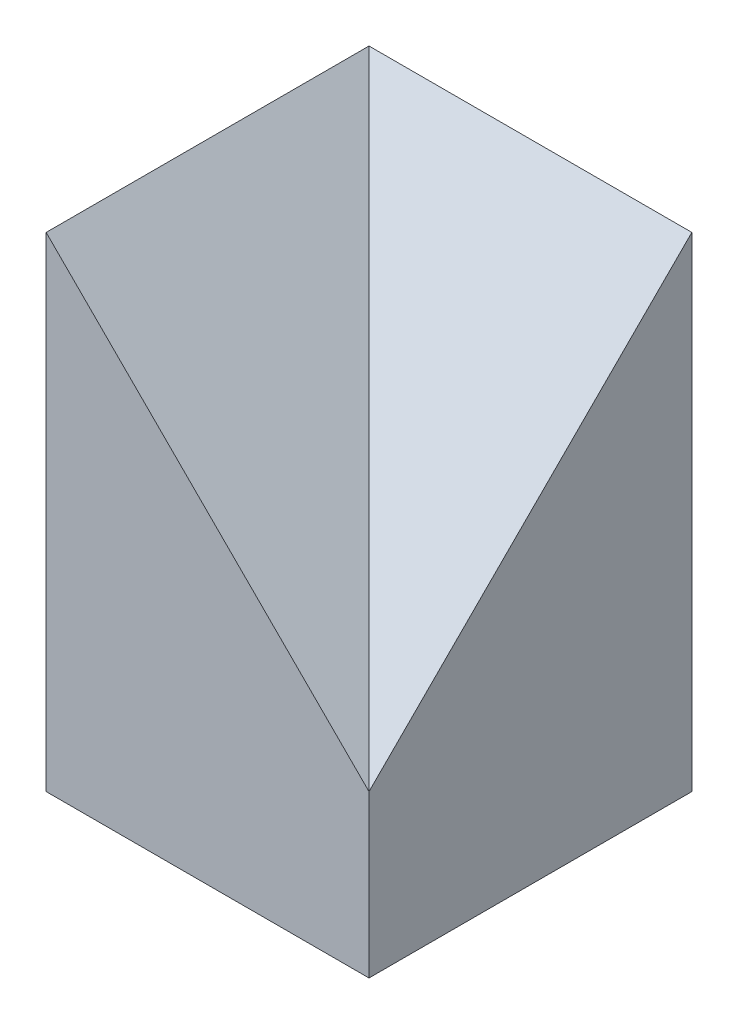
ISO-10303-21;
HEADER;
FILE_DESCRIPTION(('STEP AP214'),'2;1');
FILE_NAME('part.step','',(''),(''),'','','');
FILE_SCHEMA(('AUTOMOTIVE_DESIGN { 1 0 10303 214 1 1 1 1 }'));
ENDSEC;
DATA;
#1=APPLICATION_CONTEXT('core data for automotive mechanical design processes');
#2=APPLICATION_PROTOCOL_DEFINITION('international standard','automotive_design',2000,#1);
#3=PRODUCT_CONTEXT('',#1,'mechanical');
#4=PRODUCT('Part','Part','',(#3));
#5=PRODUCT_RELATED_PRODUCT_CATEGORY('part','',(#4));
#6=PRODUCT_DEFINITION_FORMATION('','',#4);
#7=PRODUCT_DEFINITION_CONTEXT('part definition',#1,'design');
#8=PRODUCT_DEFINITION('design','',#6,#7);
#9=PRODUCT_DEFINITION_SHAPE('','',#8);
#10=(LENGTH_UNIT() NAMED_UNIT(*) SI_UNIT(.MILLI.,.METRE.));
#11=(NAMED_UNIT(*) PLANE_ANGLE_UNIT() SI_UNIT($,.RADIAN.));
#12=(NAMED_UNIT(*) SI_UNIT($,.STERADIAN.) SOLID_ANGLE_UNIT());
#13=UNCERTAINTY_MEASURE_WITH_UNIT(LENGTH_MEASURE(1.E-05),#10,'distance_accuracy_value','');
#14=(GEOMETRIC_REPRESENTATION_CONTEXT(3) GLOBAL_UNCERTAINTY_ASSIGNED_CONTEXT((#13)) GLOBAL_UNIT_ASSIGNED_CONTEXT((#10,
#11,#12)) REPRESENTATION_CONTEXT('',''));
#15=CARTESIAN_POINT('',(0.,0.,0.));
#16=DIRECTION('',(0.,0.,1.));
#17=DIRECTION('',(1.,0.,0.));
#18=AXIS2_PLACEMENT_3D('',#15,#16,#17);
#19=CARTESIAN_POINT('',(0.,200.,0.));
#20=DIRECTION('',(1.,0.,0.));
#21=DIRECTION('',(0.,0.,-1.));
#22=AXIS2_PLACEMENT_3D('',#19,#20,#21);
#23=PLANE('',#22);
#24=DIRECTION('',(0.,0.,1.));
#25=VECTOR('',#24,1.);
#26=CARTESIAN_POINT('',(0.,0.,0.));
#27=LINE('',#26,#25);
#28=CARTESIAN_POINT('',(0.,0.,0.));
#29=VERTEX_POINT('',#28);
#30=CARTESIAN_POINT('',(0.,0.,400.));
#31=VERTEX_POINT('',#30);
#32=EDGE_CURVE('E107',#29,#31,#27,.T.);
#33=ORIENTED_EDGE('',*,*,#32,.T.);
#34=DIRECTION('',(0.,-1.,0.));
#35=VECTOR('',#34,1.);
#36=CARTESIAN_POINT('',(0.,200.,400.));
#37=LINE('',#36,#35);
#38=CARTESIAN_POINT('',(0.,600.,400.));
#39=VERTEX_POINT('',#38);
#40=EDGE_CURVE('E12',#39,#31,#37,.T.);
#41=ORIENTED_EDGE('',*,*,#40,.F.);
#42=CARTESIAN_POINT('',(0.,600.,0.));
#43=DIRECTION('',(0.,0.,1.));
#44=VECTOR('',#43,1.);
#45=LINE('',#42,#44);
#46=CARTESIAN_POINT('',(0.,600.,0.));
#47=VERTEX_POINT('',#46);
#48=EDGE_CURVE('E108',#47,#39,#45,.T.);
#49=ORIENTED_EDGE('',*,*,#48,.F.);
#50=DIRECTION('',(0.,-1.,0.));
#51=VECTOR('',#50,1.);
#52=CARTESIAN_POINT('',(0.,200.,0.));
#53=LINE('',#52,#51);
#54=EDGE_CURVE('E103',#47,#29,#53,.T.);
#55=ORIENTED_EDGE('',*,*,#54,.T.);
#56=EDGE_LOOP('',(#33,#41,#49,#55));
#57=FACE_BOUND('',#56,.T.);
#58=ADVANCED_FACE('F43',(#57),#23,.F.);
#59=CARTESIAN_POINT('',(0.,200.,400.));
#60=DIRECTION('',(0.,0.,-1.));
#61=DIRECTION('',(-1.,0.,0.));
#62=AXIS2_PLACEMENT_3D('',#59,#60,#61);
#63=PLANE('',#62);
#64=DIRECTION('',(0.,-1.,0.));
#65=VECTOR('',#64,1.);
#66=CARTESIAN_POINT('',(400.,200.,400.));
#67=LINE('',#66,#65);
#68=CARTESIAN_POINT('',(400.,200.,400.));
#69=VERTEX_POINT('',#68);
#70=CARTESIAN_POINT('',(400.,0.,400.));
#71=VERTEX_POINT('',#70);
#72=EDGE_CURVE('E54',#69,#71,#67,.T.);
#73=ORIENTED_EDGE('',*,*,#72,.F.);
#74=DIRECTION('',(0.707106781186547,-0.707106781186547,0.));
#75=VECTOR('',#74,1.);
#76=CARTESIAN_POINT('',(0.,600.,400.));
#77=LINE('',#76,#75);
#78=EDGE_CURVE('E99',#39,#69,#77,.T.);
#79=ORIENTED_EDGE('',*,*,#78,.F.);
#80=ORIENTED_EDGE('',*,*,#40,.T.);
#81=DIRECTION('',(1.,0.,0.));
#82=VECTOR('',#81,1.);
#83=CARTESIAN_POINT('',(0.,0.,400.));
#84=LINE('',#83,#82);
#85=EDGE_CURVE('E131',#31,#71,#84,.T.);
#86=ORIENTED_EDGE('',*,*,#85,.T.);
#87=EDGE_LOOP('',(#73,#79,#80,#86));
#88=FACE_BOUND('',#87,.T.);
#89=ADVANCED_FACE('F160',(#88),#63,.F.);
#90=CARTESIAN_POINT('',(400.,200.,0.));
#91=DIRECTION('',(-1.,0.,0.));
#92=DIRECTION('',(0.,0.,1.));
#93=AXIS2_PLACEMENT_3D('',#90,#91,#92);
#94=PLANE('',#93);
#95=DIRECTION('',(0.,-1.,0.));
#96=VECTOR('',#95,1.);
#97=CARTESIAN_POINT('',(400.,200.,0.));
#98=LINE('',#97,#96);
#99=CARTESIAN_POINT('',(400.,600.,0.));
#100=VERTEX_POINT('',#99);
#101=CARTESIAN_POINT('',(400.,0.,0.));
#102=VERTEX_POINT('',#101);
#103=EDGE_CURVE('E101',#100,#102,#98,.T.);
#104=ORIENTED_EDGE('',*,*,#103,.F.);
#105=DIRECTION('',(0.,-0.707106781186547,0.707106781186547));
#106=VECTOR('',#105,1.);
#107=CARTESIAN_POINT('',(400.,600.,0.));
#108=LINE('',#107,#106);
#109=EDGE_CURVE('E91',#100,#69,#108,.T.);
#110=ORIENTED_EDGE('',*,*,#109,.T.);
#111=ORIENTED_EDGE('',*,*,#72,.T.);
#112=DIRECTION('',(0.,0.,-1.));
#113=VECTOR('',#112,1.);
#114=CARTESIAN_POINT('',(400.,0.,0.));
#115=LINE('',#114,#113);
#116=EDGE_CURVE('E70',#71,#102,#115,.T.);
#117=ORIENTED_EDGE('',*,*,#116,.T.);
#118=EDGE_LOOP('',(#104,#110,#111,#117));
#119=FACE_BOUND('',#118,.T.);
#120=ADVANCED_FACE('F102',(#119),#94,.F.);
#121=CARTESIAN_POINT('',(0.,200.,0.));
#122=DIRECTION('',(0.,0.,1.));
#123=DIRECTION('',(1.,0.,0.));
#124=AXIS2_PLACEMENT_3D('',#121,#122,#123);
#125=PLANE('',#124);
#126=DIRECTION('',(-1.,0.,0.));
#127=VECTOR('',#126,1.);
#128=CARTESIAN_POINT('',(0.,0.,0.));
#129=LINE('',#128,#127);
#130=EDGE_CURVE('E62',#102,#29,#129,.T.);
#131=ORIENTED_EDGE('',*,*,#130,.T.);
#132=ORIENTED_EDGE('',*,*,#54,.F.);
#133=CARTESIAN_POINT('',(400.,600.,0.));
#134=DIRECTION('',(-1.,0.,0.));
#135=VECTOR('',#134,1.);
#136=LINE('',#133,#135);
#137=EDGE_CURVE('E94',#100,#47,#136,.T.);
#138=ORIENTED_EDGE('',*,*,#137,.F.);
#139=ORIENTED_EDGE('',*,*,#103,.T.);
#140=EDGE_LOOP('',(#131,#132,#138,#139));
#141=FACE_BOUND('',#140,.T.);
#142=ADVANCED_FACE('F105',(#141),#125,.F.);
#143=CARTESIAN_POINT('',(0.,0.,0.));
#144=DIRECTION('',(0.,1.,0.));
#145=DIRECTION('',(0.,0.,1.));
#146=AXIS2_PLACEMENT_3D('',#143,#144,#145);
#147=PLANE('',#146);
#148=ORIENTED_EDGE('',*,*,#32,.F.);
#149=ORIENTED_EDGE('',*,*,#130,.F.);
#150=ORIENTED_EDGE('',*,*,#116,.F.);
#151=ORIENTED_EDGE('',*,*,#85,.F.);
#152=EDGE_LOOP('',(#148,#149,#150,#151));
#153=FACE_BOUND('',#152,.T.);
#154=ADVANCED_FACE('F153',(#153),#147,.F.);
#155=CARTESIAN_POINT('',(0.,300.,300.));
#156=DIRECTION('',(0.,-0.707106781186548,-0.707106781186548));
#157=DIRECTION('',(0.,0.707106781186548,-0.707106781186548));
#158=AXIS2_PLACEMENT_3D('',#155,#156,#157);
#159=PLANE('',#158);
#160=ORIENTED_EDGE('',*,*,#109,.F.);
#161=ORIENTED_EDGE('',*,*,#137,.T.);
#162=DIRECTION('',(0.577350269189626,-0.577350269189626,0.577350269189626));
#163=VECTOR('',#162,1.);
#164=CARTESIAN_POINT('',(0.,600.,0.));
#165=LINE('',#164,#163);
#166=EDGE_CURVE('E96',#47,#69,#165,.T.);
#167=ORIENTED_EDGE('',*,*,#166,.T.);
#168=EDGE_LOOP('',(#160,#161,#167));
#169=FACE_BOUND('',#168,.T.);
#170=ADVANCED_FACE('F92',(#169),#159,.F.);
#171=CARTESIAN_POINT('',(300.,300.,0.));
#172=DIRECTION('',(-0.707106781186547,-0.707106781186547,0.));
#173=DIRECTION('',(0.707106781186548,-0.707106781186548,0.));
#174=AXIS2_PLACEMENT_3D('',#171,#172,#173);
#175=PLANE('',#174);
#176=ORIENTED_EDGE('',*,*,#166,.F.);
#177=ORIENTED_EDGE('',*,*,#48,.T.);
#178=ORIENTED_EDGE('',*,*,#78,.T.);
#179=EDGE_LOOP('',(#176,#177,#178));
#180=FACE_BOUND('',#179,.T.);
#181=ADVANCED_FACE('F141',(#180),#175,.F.);
#182=CLOSED_SHELL('',(#58,#89,#120,#142,#154,#170,#181));
#183=MANIFOLD_SOLID_BREP('B2',#182);
#184=ADVANCED_BREP_SHAPE_REPRESENTATION('',(#18,#183),#14);
#185=SHAPE_DEFINITION_REPRESENTATION(#9,#184);
ENDSEC;
END-ISO-10303-21;
